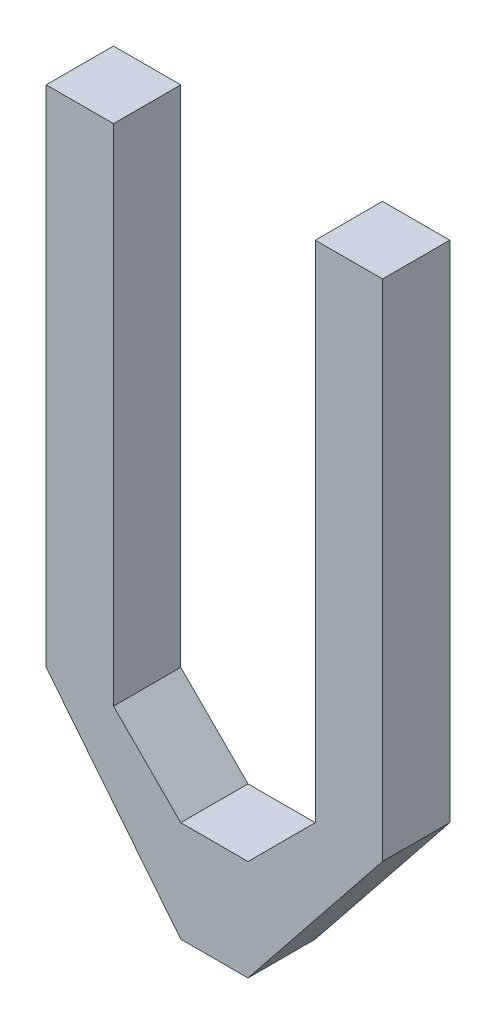
ISO-10303-21;
HEADER;
FILE_DESCRIPTION(('STEP AP214'),'2;1');
FILE_NAME('part.step','',(''),(''),'','','');
FILE_SCHEMA(('AUTOMOTIVE_DESIGN { 1 0 10303 214 1 1 1 1 }'));
ENDSEC;
DATA;
#1=APPLICATION_CONTEXT('core data for automotive mechanical design processes');
#2=APPLICATION_PROTOCOL_DEFINITION('international standard','automotive_design',2000,#1);
#3=PRODUCT_CONTEXT('',#1,'mechanical');
#4=PRODUCT('Part','Part','',(#3));
#5=PRODUCT_RELATED_PRODUCT_CATEGORY('part','',(#4));
#6=PRODUCT_DEFINITION_FORMATION('','',#4);
#7=PRODUCT_DEFINITION_CONTEXT('part definition',#1,'design');
#8=PRODUCT_DEFINITION('design','',#6,#7);
#9=PRODUCT_DEFINITION_SHAPE('','',#8);
#10=(LENGTH_UNIT() NAMED_UNIT(*) SI_UNIT(.MILLI.,.METRE.));
#11=(NAMED_UNIT(*) PLANE_ANGLE_UNIT() SI_UNIT($,.RADIAN.));
#12=(NAMED_UNIT(*) SI_UNIT($,.STERADIAN.) SOLID_ANGLE_UNIT());
#13=UNCERTAINTY_MEASURE_WITH_UNIT(LENGTH_MEASURE(1.E-05),#10,'distance_accuracy_value','');
#14=(GEOMETRIC_REPRESENTATION_CONTEXT(3) GLOBAL_UNCERTAINTY_ASSIGNED_CONTEXT((#13)) GLOBAL_UNIT_ASSIGNED_CONTEXT((#10,
#11,#12)) REPRESENTATION_CONTEXT('',''));
#15=CARTESIAN_POINT('',(0.,0.,0.));
#16=DIRECTION('',(0.,0.,1.));
#17=DIRECTION('',(1.,0.,0.));
#18=AXIS2_PLACEMENT_3D('',#15,#16,#17);
#19=CARTESIAN_POINT('',(-0.06349999999999,0.127,0.0254));
#20=DIRECTION('',(0.,0.,1.));
#21=DIRECTION('',(1.,0.,0.));
#22=AXIS2_PLACEMENT_3D('',#19,#20,#21);
#23=PLANE('',#22);
#24=DIRECTION('',(0.,1.,0.));
#25=VECTOR('',#24,1.);
#26=CARTESIAN_POINT('',(-0.0381,0.127,0.0254));
#27=LINE('',#26,#25);
#28=CARTESIAN_POINT('',(-0.0381,0.127,0.0254));
#29=VERTEX_POINT('',#28);
#30=CARTESIAN_POINT('',(-0.0381,-0.0635,0.0254));
#31=VERTEX_POINT('',#30);
#32=EDGE_CURVE('E157',#29,#31,#27,.F.);
#33=ORIENTED_EDGE('',*,*,#32,.F.);
#34=DIRECTION('',(1.,0.,0.));
#35=VECTOR('',#34,1.);
#36=CARTESIAN_POINT('',(-0.06349999999999,0.127,0.0254));
#37=LINE('',#36,#35);
#38=CARTESIAN_POINT('',(-0.06349999999999,0.127,0.0254));
#39=VERTEX_POINT('',#38);
#40=EDGE_CURVE('E118',#39,#29,#37,.T.);
#41=ORIENTED_EDGE('',*,*,#40,.F.);
#42=DIRECTION('',(0.,1.,0.));
#43=VECTOR('',#42,1.);
#44=CARTESIAN_POINT('',(-0.06349999999999,-0.0635,0.0254));
#45=LINE('',#44,#43);
#46=CARTESIAN_POINT('',(-0.063499999999999,-0.0635000000000071,0.0254));
#47=VERTEX_POINT('',#46);
#48=EDGE_CURVE('E20',#47,#39,#45,.T.);
#49=ORIENTED_EDGE('',*,*,#48,.F.);
#50=DIRECTION('',(0.62469504755479,-0.780868809442738,0.));
#51=VECTOR('',#50,1.);
#52=CARTESIAN_POINT('',(-0.0127,-0.127,0.0254));
#53=LINE('',#52,#51);
#54=CARTESIAN_POINT('',(-0.0127,-0.127,0.0254));
#55=VERTEX_POINT('',#54);
#56=EDGE_CURVE('E107',#55,#47,#53,.F.);
#57=ORIENTED_EDGE('',*,*,#56,.F.);
#58=DIRECTION('',(1.,0.,0.));
#59=VECTOR('',#58,1.);
#60=CARTESIAN_POINT('',(0.01270000000001,-0.127,0.0254));
#61=LINE('',#60,#59);
#62=CARTESIAN_POINT('',(0.012700000000001,-0.126999999999993,0.0254));
#63=VERTEX_POINT('',#62);
#64=EDGE_CURVE('E102',#63,#55,#61,.F.);
#65=ORIENTED_EDGE('',*,*,#64,.F.);
#66=DIRECTION('',(0.62469504755479,0.780868809442738,0.));
#67=VECTOR('',#66,1.);
#68=CARTESIAN_POINT('',(0.0635,-0.0635,0.0254));
#69=LINE('',#68,#67);
#70=CARTESIAN_POINT('',(0.0635,-0.0635,0.0254));
#71=VERTEX_POINT('',#70);
#72=EDGE_CURVE('E129',#71,#63,#69,.F.);
#73=ORIENTED_EDGE('',*,*,#72,.F.);
#74=DIRECTION('',(0.,1.,0.));
#75=VECTOR('',#74,1.);
#76=CARTESIAN_POINT('',(0.0635,0.127,0.0254));
#77=LINE('',#76,#75);
#78=CARTESIAN_POINT('',(0.0635,0.127,0.0254));
#79=VERTEX_POINT('',#78);
#80=EDGE_CURVE('E133',#79,#71,#77,.F.);
#81=ORIENTED_EDGE('',*,*,#80,.F.);
#82=DIRECTION('',(1.,0.,0.));
#83=VECTOR('',#82,1.);
#84=CARTESIAN_POINT('',(0.0381,0.127,0.0254));
#85=LINE('',#84,#83);
#86=CARTESIAN_POINT('',(0.0381,0.127,0.0254));
#87=VERTEX_POINT('',#86);
#88=EDGE_CURVE('E137',#87,#79,#85,.T.);
#89=ORIENTED_EDGE('',*,*,#88,.F.);
#90=DIRECTION('',(0.,1.,0.));
#91=VECTOR('',#90,1.);
#92=CARTESIAN_POINT('',(0.0381,-0.0635,0.0254));
#93=LINE('',#92,#91);
#94=CARTESIAN_POINT('',(0.0381000000000013,-0.0635000000000013,0.0254));
#95=VERTEX_POINT('',#94);
#96=EDGE_CURVE('E141',#95,#87,#93,.T.);
#97=ORIENTED_EDGE('',*,*,#96,.F.);
#98=DIRECTION('',(-0.707106781186548,-0.707106781186548,0.));
#99=VECTOR('',#98,1.);
#100=CARTESIAN_POINT('',(0.01270000000001,-0.0889,0.0254));
#101=LINE('',#100,#99);
#102=CARTESIAN_POINT('',(0.01270000000001,-0.0889,0.0254));
#103=VERTEX_POINT('',#102);
#104=EDGE_CURVE('E145',#103,#95,#101,.F.);
#105=ORIENTED_EDGE('',*,*,#104,.F.);
#106=DIRECTION('',(1.,0.,0.));
#107=VECTOR('',#106,1.);
#108=CARTESIAN_POINT('',(-0.0127,-0.0889,0.0254));
#109=LINE('',#108,#107);
#110=CARTESIAN_POINT('',(-0.0126999999999955,-0.0888999999999955,0.0254));
#111=VERTEX_POINT('',#110);
#112=EDGE_CURVE('E149',#111,#103,#109,.T.);
#113=ORIENTED_EDGE('',*,*,#112,.F.);
#114=DIRECTION('',(-0.707106781187048,0.707106781186048,0.));
#115=VECTOR('',#114,1.);
#116=CARTESIAN_POINT('',(-0.0381,-0.0635,0.0254));
#117=LINE('',#116,#115);
#118=EDGE_CURVE('E153',#31,#111,#117,.F.);
#119=ORIENTED_EDGE('',*,*,#118,.F.);
#120=EDGE_LOOP('',(#33,#41,#49,#57,#65,#73,#81,#89,#97,#105,#113,#119));
#121=FACE_BOUND('',#120,.T.);
#122=ADVANCED_FACE('F17',(#121),#23,.T.);
#123=CARTESIAN_POINT('',(-0.06349999999999,-0.0635,0.));
#124=DIRECTION('',(-1.,0.,0.));
#125=DIRECTION('',(0.,0.,1.));
#126=AXIS2_PLACEMENT_3D('',#123,#124,#125);
#127=PLANE('',#126);
#128=DIRECTION('',(0.,0.,1.));
#129=VECTOR('',#128,1.);
#130=CARTESIAN_POINT('',(-0.06349999999999,0.127,0.));
#131=LINE('',#130,#129);
#132=CARTESIAN_POINT('',(-0.06349999999999,0.127,0.));
#133=VERTEX_POINT('',#132);
#134=EDGE_CURVE('E161',#133,#39,#131,.T.);
#135=ORIENTED_EDGE('',*,*,#134,.F.);
#136=DIRECTION('',(0.,1.,0.));
#137=VECTOR('',#136,1.);
#138=CARTESIAN_POINT('',(-0.06349999999999,0.127,0.));
#139=LINE('',#138,#137);
#140=CARTESIAN_POINT('',(-0.063499999999999,-0.0635000000000071,0.));
#141=VERTEX_POINT('',#140);
#142=EDGE_CURVE('E124',#133,#141,#139,.F.);
#143=ORIENTED_EDGE('',*,*,#142,.T.);
#144=DIRECTION('',(0.,0.,1.));
#145=VECTOR('',#144,1.);
#146=CARTESIAN_POINT('',(-0.0635000000000259,-0.0635000000000287,0.));
#147=LINE('',#146,#145);
#148=EDGE_CURVE('E112',#47,#141,#147,.F.);
#149=ORIENTED_EDGE('',*,*,#148,.F.);
#150=ORIENTED_EDGE('',*,*,#48,.T.);
#151=EDGE_LOOP('',(#135,#143,#149,#150));
#152=FACE_BOUND('',#151,.T.);
#153=ADVANCED_FACE('F123',(#152),#127,.T.);
#154=CARTESIAN_POINT('',(-0.0127,-0.127,0.));
#155=DIRECTION('',(-0.780868809442738,-0.62469504755479,0.));
#156=DIRECTION('',(0.62469504755479,-0.780868809442738,0.));
#157=AXIS2_PLACEMENT_3D('',#154,#155,#156);
#158=PLANE('',#157);
#159=ORIENTED_EDGE('',*,*,#148,.T.);
#160=DIRECTION('',(0.624695047554349,-0.78086880944309,0.));
#161=VECTOR('',#160,1.);
#162=CARTESIAN_POINT('',(-0.06349999999999,-0.0635,0.));
#163=LINE('',#162,#161);
#164=CARTESIAN_POINT('',(-0.0127,-0.127,0.));
#165=VERTEX_POINT('',#164);
#166=EDGE_CURVE('E166',#141,#165,#163,.T.);
#167=ORIENTED_EDGE('',*,*,#166,.T.);
#168=DIRECTION('',(0.,0.,-1.));
#169=VECTOR('',#168,1.);
#170=CARTESIAN_POINT('',(-0.0127,-0.127,0.));
#171=LINE('',#170,#169);
#172=EDGE_CURVE('E114',#55,#165,#171,.T.);
#173=ORIENTED_EDGE('',*,*,#172,.F.);
#174=ORIENTED_EDGE('',*,*,#56,.T.);
#175=EDGE_LOOP('',(#159,#167,#173,#174));
#176=FACE_BOUND('',#175,.T.);
#177=ADVANCED_FACE('F109',(#176),#158,.T.);
#178=CARTESIAN_POINT('',(0.01270000000001,-0.127,0.));
#179=DIRECTION('',(0.,-1.,0.));
#180=DIRECTION('',(0.,0.,-1.));
#181=AXIS2_PLACEMENT_3D('',#178,#179,#180);
#182=PLANE('',#181);
#183=ORIENTED_EDGE('',*,*,#172,.T.);
#184=DIRECTION('',(1.,0.,0.));
#185=VECTOR('',#184,1.);
#186=CARTESIAN_POINT('',(-0.06349999999999,-0.127,0.));
#187=LINE('',#186,#185);
#188=CARTESIAN_POINT('',(0.012700000000001,-0.126999999999993,0.));
#189=VERTEX_POINT('',#188);
#190=EDGE_CURVE('E168',#165,#189,#187,.T.);
#191=ORIENTED_EDGE('',*,*,#190,.T.);
#192=DIRECTION('',(0.,0.,1.));
#193=VECTOR('',#192,1.);
#194=CARTESIAN_POINT('',(0.0126999999999741,-0.126999999999971,0.));
#195=LINE('',#194,#193);
#196=EDGE_CURVE('E131',#63,#189,#195,.F.);
#197=ORIENTED_EDGE('',*,*,#196,.F.);
#198=ORIENTED_EDGE('',*,*,#64,.T.);
#199=EDGE_LOOP('',(#183,#191,#197,#198));
#200=FACE_BOUND('',#199,.T.);
#201=ADVANCED_FACE('F234',(#200),#182,.T.);
#202=CARTESIAN_POINT('',(0.0635,-0.0635,0.));
#203=DIRECTION('',(0.780868809442738,-0.62469504755479,0.));
#204=DIRECTION('',(0.62469504755479,0.780868809442738,0.));
#205=AXIS2_PLACEMENT_3D('',#202,#203,#204);
#206=PLANE('',#205);
#207=ORIENTED_EDGE('',*,*,#196,.T.);
#208=DIRECTION('',(0.624695047554349,0.78086880944309,0.));
#209=VECTOR('',#208,1.);
#210=CARTESIAN_POINT('',(0.01270000000001,-0.127,0.));
#211=LINE('',#210,#209);
#212=CARTESIAN_POINT('',(0.0635,-0.0635,0.));
#213=VERTEX_POINT('',#212);
#214=EDGE_CURVE('E171',#189,#213,#211,.T.);
#215=ORIENTED_EDGE('',*,*,#214,.T.);
#216=DIRECTION('',(0.,0.,-1.));
#217=VECTOR('',#216,1.);
#218=CARTESIAN_POINT('',(0.0635,-0.0635,0.));
#219=LINE('',#218,#217);
#220=EDGE_CURVE('E135',#71,#213,#219,.T.);
#221=ORIENTED_EDGE('',*,*,#220,.F.);
#222=ORIENTED_EDGE('',*,*,#72,.T.);
#223=EDGE_LOOP('',(#207,#215,#221,#222));
#224=FACE_BOUND('',#223,.T.);
#225=ADVANCED_FACE('F233',(#224),#206,.T.);
#226=CARTESIAN_POINT('',(0.0635,0.127,0.));
#227=DIRECTION('',(1.,0.,0.));
#228=DIRECTION('',(0.,0.,-1.));
#229=AXIS2_PLACEMENT_3D('',#226,#227,#228);
#230=PLANE('',#229);
#231=ORIENTED_EDGE('',*,*,#220,.T.);
#232=DIRECTION('',(0.,1.,0.));
#233=VECTOR('',#232,1.);
#234=CARTESIAN_POINT('',(0.0635,0.127,0.));
#235=LINE('',#234,#233);
#236=CARTESIAN_POINT('',(0.0635,0.127,0.));
#237=VERTEX_POINT('',#236);
#238=EDGE_CURVE('E174',#213,#237,#235,.T.);
#239=ORIENTED_EDGE('',*,*,#238,.T.);
#240=DIRECTION('',(0.,0.,1.));
#241=VECTOR('',#240,1.);
#242=CARTESIAN_POINT('',(0.0635,0.127,0.));
#243=LINE('',#242,#241);
#244=EDGE_CURVE('E139',#79,#237,#243,.F.);
#245=ORIENTED_EDGE('',*,*,#244,.F.);
#246=ORIENTED_EDGE('',*,*,#80,.T.);
#247=EDGE_LOOP('',(#231,#239,#245,#246));
#248=FACE_BOUND('',#247,.T.);
#249=ADVANCED_FACE('F227',(#248),#230,.T.);
#250=CARTESIAN_POINT('',(0.0381,0.127,0.));
#251=DIRECTION('',(0.,1.,0.));
#252=DIRECTION('',(0.,0.,1.));
#253=AXIS2_PLACEMENT_3D('',#250,#251,#252);
#254=PLANE('',#253);
#255=ORIENTED_EDGE('',*,*,#244,.T.);
#256=DIRECTION('',(1.,0.,0.));
#257=VECTOR('',#256,1.);
#258=CARTESIAN_POINT('',(-0.06349999999999,0.127,0.));
#259=LINE('',#258,#257);
#260=CARTESIAN_POINT('',(0.0381,0.127,0.));
#261=VERTEX_POINT('',#260);
#262=EDGE_CURVE('E177',#237,#261,#259,.F.);
#263=ORIENTED_EDGE('',*,*,#262,.T.);
#264=DIRECTION('',(0.,0.,1.));
#265=VECTOR('',#264,1.);
#266=CARTESIAN_POINT('',(0.0381,0.127,0.));
#267=LINE('',#266,#265);
#268=EDGE_CURVE('E143',#87,#261,#267,.F.);
#269=ORIENTED_EDGE('',*,*,#268,.F.);
#270=ORIENTED_EDGE('',*,*,#88,.T.);
#271=EDGE_LOOP('',(#255,#263,#269,#270));
#272=FACE_BOUND('',#271,.T.);
#273=ADVANCED_FACE('F223',(#272),#254,.T.);
#274=CARTESIAN_POINT('',(0.0381,-0.0635,0.));
#275=DIRECTION('',(-1.,0.,0.));
#276=DIRECTION('',(0.,0.,1.));
#277=AXIS2_PLACEMENT_3D('',#274,#275,#276);
#278=PLANE('',#277);
#279=ORIENTED_EDGE('',*,*,#268,.T.);
#280=DIRECTION('',(0.,1.,0.));
#281=VECTOR('',#280,1.);
#282=CARTESIAN_POINT('',(0.0381,0.127,0.));
#283=LINE('',#282,#281);
#284=CARTESIAN_POINT('',(0.0381000000000013,-0.0635000000000012,0.));
#285=VERTEX_POINT('',#284);
#286=EDGE_CURVE('E180',#261,#285,#283,.F.);
#287=ORIENTED_EDGE('',*,*,#286,.T.);
#288=DIRECTION('',(0.,0.,1.));
#289=VECTOR('',#288,1.);
#290=CARTESIAN_POINT('',(0.038100000000005,-0.063500000000005,0.));
#291=LINE('',#290,#289);
#292=EDGE_CURVE('E147',#95,#285,#291,.F.);
#293=ORIENTED_EDGE('',*,*,#292,.F.);
#294=ORIENTED_EDGE('',*,*,#96,.T.);
#295=EDGE_LOOP('',(#279,#287,#293,#294));
#296=FACE_BOUND('',#295,.T.);
#297=ADVANCED_FACE('F217',(#296),#278,.T.);
#298=CARTESIAN_POINT('',(0.01270000000001,-0.0889,0.));
#299=DIRECTION('',(-0.707106781186548,0.707106781186548,0.));
#300=DIRECTION('',(-0.707106781186548,-0.707106781186548,0.));
#301=AXIS2_PLACEMENT_3D('',#298,#299,#300);
#302=PLANE('',#301);
#303=ORIENTED_EDGE('',*,*,#292,.T.);
#304=DIRECTION('',(-0.707106781186408,-0.707106781186687,0.));
#305=VECTOR('',#304,1.);
#306=CARTESIAN_POINT('',(0.0381,-0.0635,0.));
#307=LINE('',#306,#305);
#308=CARTESIAN_POINT('',(0.01270000000001,-0.0889,0.));
#309=VERTEX_POINT('',#308);
#310=EDGE_CURVE('E183',#285,#309,#307,.T.);
#311=ORIENTED_EDGE('',*,*,#310,.T.);
#312=DIRECTION('',(0.,0.,1.));
#313=VECTOR('',#312,1.);
#314=CARTESIAN_POINT('',(0.01270000000001,-0.0889,0.));
#315=LINE('',#314,#313);
#316=EDGE_CURVE('E151',#103,#309,#315,.F.);
#317=ORIENTED_EDGE('',*,*,#316,.F.);
#318=ORIENTED_EDGE('',*,*,#104,.T.);
#319=EDGE_LOOP('',(#303,#311,#317,#318));
#320=FACE_BOUND('',#319,.T.);
#321=ADVANCED_FACE('F213',(#320),#302,.T.);
#322=CARTESIAN_POINT('',(-0.0127,-0.0889,0.));
#323=DIRECTION('',(0.,1.,0.));
#324=DIRECTION('',(0.,0.,1.));
#325=AXIS2_PLACEMENT_3D('',#322,#323,#324);
#326=PLANE('',#325);
#327=ORIENTED_EDGE('',*,*,#316,.T.);
#328=DIRECTION('',(1.,0.,0.));
#329=VECTOR('',#328,1.);
#330=CARTESIAN_POINT('',(-0.06349999999999,-0.0889,0.));
#331=LINE('',#330,#329);
#332=CARTESIAN_POINT('',(-0.0126999999999955,-0.0888999999999955,0.));
#333=VERTEX_POINT('',#332);
#334=EDGE_CURVE('E186',#309,#333,#331,.F.);
#335=ORIENTED_EDGE('',*,*,#334,.T.);
#336=DIRECTION('',(0.,0.,1.));
#337=VECTOR('',#336,1.);
#338=CARTESIAN_POINT('',(-0.012699999999982,-0.088899999999982,0.));
#339=LINE('',#338,#337);
#340=EDGE_CURVE('E155',#111,#333,#339,.F.);
#341=ORIENTED_EDGE('',*,*,#340,.F.);
#342=ORIENTED_EDGE('',*,*,#112,.T.);
#343=EDGE_LOOP('',(#327,#335,#341,#342));
#344=FACE_BOUND('',#343,.T.);
#345=ADVANCED_FACE('F207',(#344),#326,.T.);
#346=CARTESIAN_POINT('',(-0.0381,-0.0635,0.));
#347=DIRECTION('',(0.707106781186048,0.707106781187048,0.));
#348=DIRECTION('',(-0.707106781187048,0.707106781186048,0.));
#349=AXIS2_PLACEMENT_3D('',#346,#347,#348);
#350=PLANE('',#349);
#351=ORIENTED_EDGE('',*,*,#340,.T.);
#352=DIRECTION('',(-0.707106781186548,0.707106781186547,0.));
#353=VECTOR('',#352,1.);
#354=CARTESIAN_POINT('',(-0.0127,-0.0889,0.));
#355=LINE('',#354,#353);
#356=CARTESIAN_POINT('',(-0.0381,-0.0635,0.));
#357=VERTEX_POINT('',#356);
#358=EDGE_CURVE('E189',#333,#357,#355,.T.);
#359=ORIENTED_EDGE('',*,*,#358,.T.);
#360=DIRECTION('',(0.,0.,-1.));
#361=VECTOR('',#360,1.);
#362=CARTESIAN_POINT('',(-0.0381,-0.0635,0.));
#363=LINE('',#362,#361);
#364=EDGE_CURVE('E159',#31,#357,#363,.T.);
#365=ORIENTED_EDGE('',*,*,#364,.F.);
#366=ORIENTED_EDGE('',*,*,#118,.T.);
#367=EDGE_LOOP('',(#351,#359,#365,#366));
#368=FACE_BOUND('',#367,.T.);
#369=ADVANCED_FACE('F202',(#368),#350,.T.);
#370=CARTESIAN_POINT('',(-0.0381,0.127,0.));
#371=DIRECTION('',(1.,0.,0.));
#372=DIRECTION('',(0.,0.,-1.));
#373=AXIS2_PLACEMENT_3D('',#370,#371,#372);
#374=PLANE('',#373);
#375=ORIENTED_EDGE('',*,*,#364,.T.);
#376=DIRECTION('',(0.,1.,0.));
#377=VECTOR('',#376,1.);
#378=CARTESIAN_POINT('',(-0.0381,0.127,0.));
#379=LINE('',#378,#377);
#380=CARTESIAN_POINT('',(-0.0381,0.127,0.));
#381=VERTEX_POINT('',#380);
#382=EDGE_CURVE('E26',#357,#381,#379,.T.);
#383=ORIENTED_EDGE('',*,*,#382,.T.);
#384=DIRECTION('',(0.,0.,1.));
#385=VECTOR('',#384,1.);
#386=CARTESIAN_POINT('',(-0.0381,0.127,0.));
#387=LINE('',#386,#385);
#388=EDGE_CURVE('E34',#29,#381,#387,.F.);
#389=ORIENTED_EDGE('',*,*,#388,.F.);
#390=ORIENTED_EDGE('',*,*,#32,.T.);
#391=EDGE_LOOP('',(#375,#383,#389,#390));
#392=FACE_BOUND('',#391,.T.);
#393=ADVANCED_FACE('F195',(#392),#374,.T.);
#394=CARTESIAN_POINT('',(-0.06349999999999,0.127,0.));
#395=DIRECTION('',(0.,1.,0.));
#396=DIRECTION('',(0.,0.,1.));
#397=AXIS2_PLACEMENT_3D('',#394,#395,#396);
#398=PLANE('',#397);
#399=ORIENTED_EDGE('',*,*,#388,.T.);
#400=DIRECTION('',(1.,0.,0.));
#401=VECTOR('',#400,1.);
#402=CARTESIAN_POINT('',(-0.06349999999999,0.127,0.));
#403=LINE('',#402,#401);
#404=EDGE_CURVE('E11',#381,#133,#403,.F.);
#405=ORIENTED_EDGE('',*,*,#404,.T.);
#406=ORIENTED_EDGE('',*,*,#134,.T.);
#407=ORIENTED_EDGE('',*,*,#40,.T.);
#408=EDGE_LOOP('',(#399,#405,#406,#407));
#409=FACE_BOUND('',#408,.T.);
#410=ADVANCED_FACE('F235',(#409),#398,.T.);
#411=CARTESIAN_POINT('',(-0.06349999999999,0.127,0.));
#412=DIRECTION('',(0.,0.,1.));
#413=DIRECTION('',(1.,0.,0.));
#414=AXIS2_PLACEMENT_3D('',#411,#412,#413);
#415=PLANE('',#414);
#416=ORIENTED_EDGE('',*,*,#382,.F.);
#417=ORIENTED_EDGE('',*,*,#358,.F.);
#418=ORIENTED_EDGE('',*,*,#334,.F.);
#419=ORIENTED_EDGE('',*,*,#310,.F.);
#420=ORIENTED_EDGE('',*,*,#286,.F.);
#421=ORIENTED_EDGE('',*,*,#262,.F.);
#422=ORIENTED_EDGE('',*,*,#238,.F.);
#423=ORIENTED_EDGE('',*,*,#214,.F.);
#424=ORIENTED_EDGE('',*,*,#190,.F.);
#425=ORIENTED_EDGE('',*,*,#166,.F.);
#426=ORIENTED_EDGE('',*,*,#142,.F.);
#427=ORIENTED_EDGE('',*,*,#404,.F.);
#428=EDGE_LOOP('',(#416,#417,#418,#419,#420,#421,#422,#423,#424,#425,#426,#427));
#429=FACE_BOUND('',#428,.T.);
#430=ADVANCED_FACE('F199',(#429),#415,.F.);
#431=CLOSED_SHELL('',(#122,#153,#177,#201,#225,#249,#273,#297,#321,#345,#369,#393,#410,#430));
#432=MANIFOLD_SOLID_BREP('B1',#431);
#433=ADVANCED_BREP_SHAPE_REPRESENTATION('',(#18,#432),#14);
#434=SHAPE_DEFINITION_REPRESENTATION(#9,#433);
ENDSEC;
END-ISO-10303-21;
